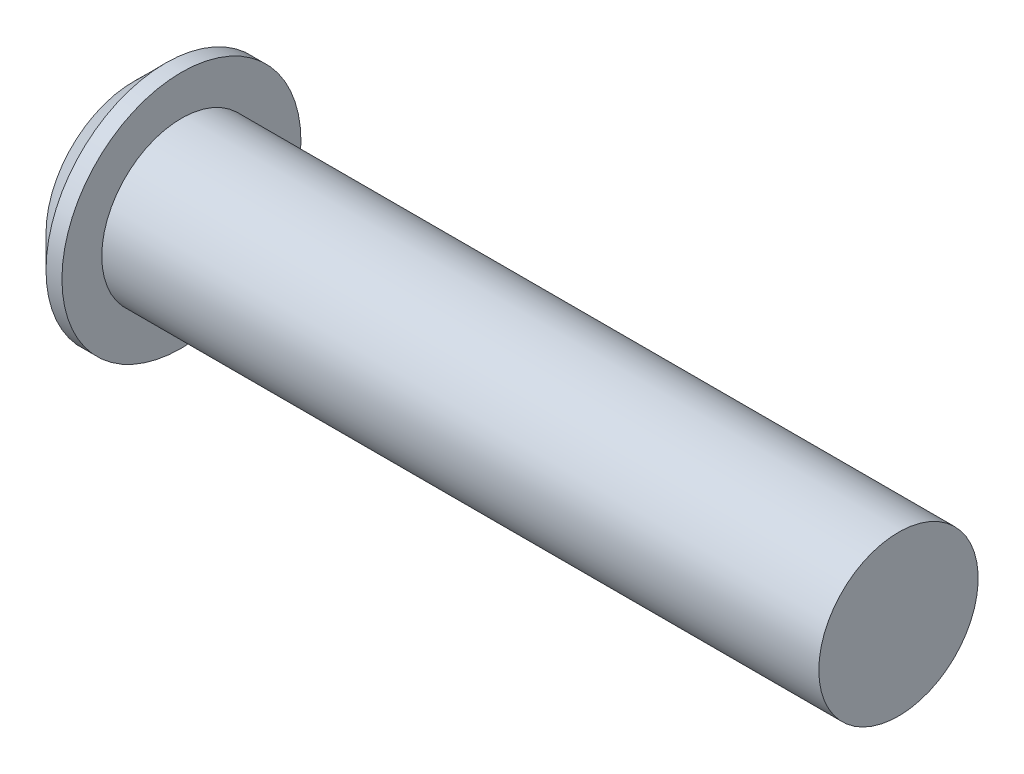
ISO-10303-21;
HEADER;
FILE_DESCRIPTION(('STEP AP214'),'2;1');
FILE_NAME('part.step','',(''),(''),'','','');
FILE_SCHEMA(('AUTOMOTIVE_DESIGN { 1 0 10303 214 1 1 1 1 }'));
ENDSEC;
DATA;
#1=APPLICATION_CONTEXT('core data for automotive mechanical design processes');
#2=APPLICATION_PROTOCOL_DEFINITION('international standard','automotive_design',2000,#1);
#3=PRODUCT_CONTEXT('',#1,'mechanical');
#4=PRODUCT('Part','Part','',(#3));
#5=PRODUCT_RELATED_PRODUCT_CATEGORY('part','',(#4));
#6=PRODUCT_DEFINITION_FORMATION('','',#4);
#7=PRODUCT_DEFINITION_CONTEXT('part definition',#1,'design');
#8=PRODUCT_DEFINITION('design','',#6,#7);
#9=PRODUCT_DEFINITION_SHAPE('','',#8);
#10=(LENGTH_UNIT() NAMED_UNIT(*) SI_UNIT(.MILLI.,.METRE.));
#11=(NAMED_UNIT(*) PLANE_ANGLE_UNIT() SI_UNIT($,.RADIAN.));
#12=(NAMED_UNIT(*) SI_UNIT($,.STERADIAN.) SOLID_ANGLE_UNIT());
#13=UNCERTAINTY_MEASURE_WITH_UNIT(LENGTH_MEASURE(1.E-05),#10,'distance_accuracy_value','');
#14=(GEOMETRIC_REPRESENTATION_CONTEXT(3) GLOBAL_UNCERTAINTY_ASSIGNED_CONTEXT((#13)) GLOBAL_UNIT_ASSIGNED_CONTEXT((#10,
#11,#12)) REPRESENTATION_CONTEXT('',''));
#15=CARTESIAN_POINT('',(0.,0.,0.));
#16=DIRECTION('',(0.,0.,1.));
#17=DIRECTION('',(1.,0.,0.));
#18=AXIS2_PLACEMENT_3D('',#15,#16,#17);
#19=CARTESIAN_POINT('',(48.,0.,0.));
#20=DIRECTION('',(-1.,0.,0.));
#21=DIRECTION('',(0.,0.,1.));
#22=AXIS2_PLACEMENT_3D('',#19,#20,#21);
#23=PLANE('',#22);
#24=CARTESIAN_POINT('',(48.,0.,0.));
#25=DIRECTION('',(-1.,0.,0.));
#26=DIRECTION('',(0.,0.,1.));
#27=AXIS2_PLACEMENT_3D('',#24,#25,#26);
#28=CIRCLE('',#27,5.);
#29=CARTESIAN_POINT('',(48.,0.,5.));
#30=VERTEX_POINT('',#29);
#31=EDGE_CURVE('E46',#30,#30,#28,.T.);
#32=ORIENTED_EDGE('',*,*,#31,.F.);
#33=EDGE_LOOP('',(#32));
#34=FACE_BOUND('',#33,.T.);
#35=ADVANCED_FACE('F35',(#34),#23,.F.);
#36=CARTESIAN_POINT('',(3.,0.,0.));
#37=DIRECTION('',(-1.,0.,0.));
#38=DIRECTION('',(0.,0.,1.));
#39=AXIS2_PLACEMENT_3D('',#36,#37,#38);
#40=CYLINDRICAL_SURFACE('',#39,5.);
#41=ORIENTED_EDGE('',*,*,#31,.T.);
#42=EDGE_LOOP('',(#41));
#43=FACE_BOUND('',#42,.T.);
#44=CARTESIAN_POINT('',(3.,0.,0.));
#45=DIRECTION('',(-1.,0.,0.));
#46=DIRECTION('',(0.,0.,1.));
#47=AXIS2_PLACEMENT_3D('',#44,#45,#46);
#48=CIRCLE('',#47,5.);
#49=CARTESIAN_POINT('',(3.,0.,5.));
#50=VERTEX_POINT('',#49);
#51=EDGE_CURVE('E50',#50,#50,#48,.T.);
#52=ORIENTED_EDGE('',*,*,#51,.F.);
#53=EDGE_LOOP('',(#52));
#54=FACE_BOUND('',#53,.T.);
#55=ADVANCED_FACE('F64',(#43,#54),#40,.T.);
#56=CARTESIAN_POINT('',(3.,0.,0.));
#57=DIRECTION('',(-1.,0.,0.));
#58=DIRECTION('',(0.,0.,1.));
#59=AXIS2_PLACEMENT_3D('',#56,#57,#58);
#60=PLANE('',#59);
#61=CARTESIAN_POINT('',(3.,0.,0.));
#62=DIRECTION('',(-1.,0.,0.));
#63=DIRECTION('',(0.,0.,1.));
#64=AXIS2_PLACEMENT_3D('',#61,#62,#63);
#65=CIRCLE('',#64,7.5);
#66=CARTESIAN_POINT('',(3.,0.,7.5));
#67=VERTEX_POINT('',#66);
#68=EDGE_CURVE('E55',#67,#67,#65,.T.);
#69=ORIENTED_EDGE('',*,*,#68,.F.);
#70=EDGE_LOOP('',(#69));
#71=FACE_BOUND('',#70,.T.);
#72=ORIENTED_EDGE('',*,*,#51,.T.);
#73=EDGE_LOOP('',(#72));
#74=FACE_BOUND('',#73,.T.);
#75=ADVANCED_FACE('F61',(#71,#74),#60,.F.);
#76=CARTESIAN_POINT('',(3.,0.,0.));
#77=DIRECTION('',(-1.,0.,0.));
#78=DIRECTION('',(0.,0.,1.));
#79=AXIS2_PLACEMENT_3D('',#76,#77,#78);
#80=CYLINDRICAL_SURFACE('',#79,7.5);
#81=CARTESIAN_POINT('',(2.00000000000001,0.,0.));
#82=DIRECTION('',(-1.,0.,0.));
#83=DIRECTION('',(0.,0.,1.));
#84=AXIS2_PLACEMENT_3D('',#81,#82,#83);
#85=CIRCLE('',#84,7.5);
#86=CARTESIAN_POINT('',(2.00000000000001,0.,7.5));
#87=VERTEX_POINT('',#86);
#88=EDGE_CURVE('E10',#87,#87,#85,.F.);
#89=ORIENTED_EDGE('',*,*,#88,.T.);
#90=EDGE_LOOP('',(#89));
#91=FACE_BOUND('',#90,.T.);
#92=ORIENTED_EDGE('',*,*,#68,.T.);
#93=EDGE_LOOP('',(#92));
#94=FACE_BOUND('',#93,.T.);
#95=ADVANCED_FACE('F59',(#91,#94),#80,.T.);
#96=CARTESIAN_POINT('',(0.,0.,0.));
#97=DIRECTION('',(-1.,0.,0.));
#98=DIRECTION('',(0.,0.,1.));
#99=AXIS2_PLACEMENT_3D('',#96,#97,#98);
#100=PLANE('',#99);
#101=CARTESIAN_POINT('',(0.,0.,0.));
#102=DIRECTION('',(-1.,0.,0.));
#103=DIRECTION('',(0.,0.,1.));
#104=AXIS2_PLACEMENT_3D('',#101,#102,#103);
#105=CIRCLE('',#104,5.49999999999999);
#106=CARTESIAN_POINT('',(0.,0.,5.49999999999999));
#107=VERTEX_POINT('',#106);
#108=EDGE_CURVE('E42',#107,#107,#105,.T.);
#109=ORIENTED_EDGE('',*,*,#108,.T.);
#110=EDGE_LOOP('',(#109));
#111=FACE_BOUND('',#110,.T.);
#112=ADVANCED_FACE('F78',(#111),#100,.T.);
#113=CARTESIAN_POINT('',(0.,0.,0.));
#114=DIRECTION('',(1.,0.,0.));
#115=DIRECTION('',(0.,0.,-1.));
#116=AXIS2_PLACEMENT_3D('',#113,#114,#115);
#117=CONICAL_SURFACE('',#116,5.49999999999999,0.785398163397447);
#118=ORIENTED_EDGE('',*,*,#88,.F.);
#119=EDGE_LOOP('',(#118));
#120=FACE_BOUND('',#119,.T.);
#121=ORIENTED_EDGE('',*,*,#108,.F.);
#122=EDGE_LOOP('',(#121));
#123=FACE_BOUND('',#122,.T.);
#124=ADVANCED_FACE('F37',(#120,#123),#117,.T.);
#125=CLOSED_SHELL('',(#35,#55,#75,#95,#112,#124));
#126=MANIFOLD_SOLID_BREP('B2',#125);
#127=ADVANCED_BREP_SHAPE_REPRESENTATION('',(#18,#126),#14);
#128=SHAPE_DEFINITION_REPRESENTATION(#9,#127);
ENDSEC;
END-ISO-10303-21;
